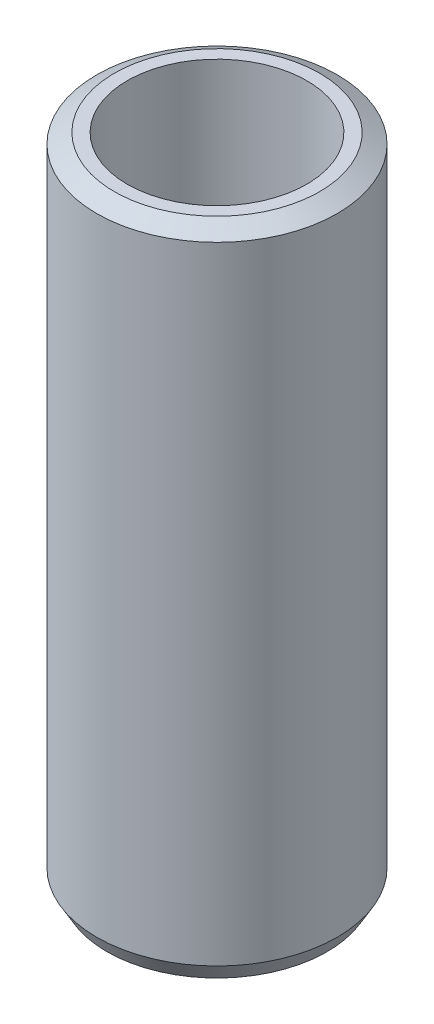
ISO-10303-21;
HEADER;
FILE_DESCRIPTION(('STEP AP214'),'2;1');
FILE_NAME('part.step','',(''),(''),'','','');
FILE_SCHEMA(('AUTOMOTIVE_DESIGN { 1 0 10303 214 1 1 1 1 }'));
ENDSEC;
DATA;
#1=APPLICATION_CONTEXT('core data for automotive mechanical design processes');
#2=APPLICATION_PROTOCOL_DEFINITION('international standard','automotive_design',2000,#1);
#3=PRODUCT_CONTEXT('',#1,'mechanical');
#4=PRODUCT('Part','Part','',(#3));
#5=PRODUCT_RELATED_PRODUCT_CATEGORY('part','',(#4));
#6=PRODUCT_DEFINITION_FORMATION('','',#4);
#7=PRODUCT_DEFINITION_CONTEXT('part definition',#1,'design');
#8=PRODUCT_DEFINITION('design','',#6,#7);
#9=PRODUCT_DEFINITION_SHAPE('','',#8);
#10=(LENGTH_UNIT() NAMED_UNIT(*) SI_UNIT(.MILLI.,.METRE.));
#11=(NAMED_UNIT(*) PLANE_ANGLE_UNIT() SI_UNIT($,.RADIAN.));
#12=(NAMED_UNIT(*) SI_UNIT($,.STERADIAN.) SOLID_ANGLE_UNIT());
#13=UNCERTAINTY_MEASURE_WITH_UNIT(LENGTH_MEASURE(1.E-05),#10,'distance_accuracy_value','');
#14=(GEOMETRIC_REPRESENTATION_CONTEXT(3) GLOBAL_UNCERTAINTY_ASSIGNED_CONTEXT((#13)) GLOBAL_UNIT_ASSIGNED_CONTEXT((#10,
#11,#12)) REPRESENTATION_CONTEXT('',''));
#15=CARTESIAN_POINT('',(0.,0.,0.));
#16=DIRECTION('',(0.,0.,1.));
#17=DIRECTION('',(1.,0.,0.));
#18=AXIS2_PLACEMENT_3D('',#15,#16,#17);
#19=CARTESIAN_POINT('',(0.,108.857491612631,0.));
#20=DIRECTION('',(0.,-1.,0.));
#21=DIRECTION('',(0.,0.,-1.));
#22=AXIS2_PLACEMENT_3D('',#19,#20,#21);
#23=CYLINDRICAL_SURFACE('',#22,20.);
#24=CARTESIAN_POINT('',(0.,107.166747624013,0.));
#25=DIRECTION('',(0.,1.,0.));
#26=DIRECTION('',(0.,0.,1.));
#27=AXIS2_PLACEMENT_3D('',#24,#25,#26);
#28=CIRCLE('',#27,20.);
#29=CARTESIAN_POINT('',(0.,107.166747624013,-20.));
#30=VERTEX_POINT('',#29);
#31=EDGE_CURVE('E50',#30,#30,#28,.F.);
#32=ORIENTED_EDGE('',*,*,#31,.T.);
#33=EDGE_LOOP('',(#32));
#34=FACE_BOUND('',#33,.T.);
#35=CARTESIAN_POINT('',(0.,2.92845449087716,0.));
#36=DIRECTION('',(0.,1.,0.));
#37=DIRECTION('',(0.,0.,1.));
#38=AXIS2_PLACEMENT_3D('',#35,#36,#37);
#39=CIRCLE('',#38,20.);
#40=CARTESIAN_POINT('',(0.,2.92845449087716,20.));
#41=VERTEX_POINT('',#40);
#42=EDGE_CURVE('E51',#41,#41,#39,.T.);
#43=ORIENTED_EDGE('',*,*,#42,.T.);
#44=EDGE_LOOP('',(#43));
#45=FACE_BOUND('',#44,.T.);
#46=ADVANCED_FACE('F39',(#34,#45),#23,.T.);
#47=CARTESIAN_POINT('',(0.,108.857491612631,0.));
#48=DIRECTION('',(0.,1.,0.));
#49=DIRECTION('',(0.,0.,1.));
#50=AXIS2_PLACEMENT_3D('',#47,#48,#49);
#51=PLANE('',#50);
#52=CARTESIAN_POINT('',(0.,108.857491612631,0.));
#53=DIRECTION('',(0.,1.,0.));
#54=DIRECTION('',(0.,0.,1.));
#55=AXIS2_PLACEMENT_3D('',#52,#53,#54);
#56=CIRCLE('',#55,17.0715455091228);
#57=CARTESIAN_POINT('',(0.,108.857491612631,-17.0715455091228));
#58=VERTEX_POINT('',#57);
#59=EDGE_CURVE('E54',#58,#58,#56,.T.);
#60=ORIENTED_EDGE('',*,*,#59,.T.);
#61=EDGE_LOOP('',(#60));
#62=FACE_BOUND('',#61,.T.);
#63=CARTESIAN_POINT('',(0.,108.857491612631,0.));
#64=DIRECTION('',(0.,1.,0.));
#65=DIRECTION('',(0.,0.,1.));
#66=AXIS2_PLACEMENT_3D('',#63,#64,#65);
#67=CIRCLE('',#66,14.9315232314958);
#68=CARTESIAN_POINT('',(0.,108.857491612631,14.9315232314958));
#69=VERTEX_POINT('',#68);
#70=EDGE_CURVE('E58',#69,#69,#67,.T.);
#71=ORIENTED_EDGE('',*,*,#70,.F.);
#72=EDGE_LOOP('',(#71));
#73=FACE_BOUND('',#72,.T.);
#74=ADVANCED_FACE('F69',(#62,#73),#51,.T.);
#75=CARTESIAN_POINT('',(0.,0.,0.));
#76=DIRECTION('',(0.,1.,0.));
#77=DIRECTION('',(0.,0.,1.));
#78=AXIS2_PLACEMENT_3D('',#75,#76,#77);
#79=PLANE('',#78);
#80=CARTESIAN_POINT('',(0.,0.,0.));
#81=DIRECTION('',(0.,1.,0.));
#82=DIRECTION('',(0.,0.,1.));
#83=AXIS2_PLACEMENT_3D('',#80,#81,#82);
#84=CIRCLE('',#83,18.3092560113825);
#85=CARTESIAN_POINT('',(0.,0.,18.3092560113825));
#86=VERTEX_POINT('',#85);
#87=EDGE_CURVE('E10',#86,#86,#84,.F.);
#88=ORIENTED_EDGE('',*,*,#87,.T.);
#89=EDGE_LOOP('',(#88));
#90=FACE_BOUND('',#89,.T.);
#91=CARTESIAN_POINT('',(0.,0.,0.));
#92=DIRECTION('',(0.,1.,0.));
#93=DIRECTION('',(0.,0.,1.));
#94=AXIS2_PLACEMENT_3D('',#91,#92,#93);
#95=CIRCLE('',#94,14.9315232314958);
#96=CARTESIAN_POINT('',(0.,0.,14.9315232314958));
#97=VERTEX_POINT('',#96);
#98=EDGE_CURVE('E63',#97,#97,#95,.T.);
#99=ORIENTED_EDGE('',*,*,#98,.T.);
#100=EDGE_LOOP('',(#99));
#101=FACE_BOUND('',#100,.T.);
#102=ADVANCED_FACE('F75',(#90,#101),#79,.F.);
#103=CARTESIAN_POINT('',(0.,108.857491612631,0.));
#104=DIRECTION('',(0.,-1.,0.));
#105=DIRECTION('',(0.,0.,-1.));
#106=AXIS2_PLACEMENT_3D('',#103,#104,#105);
#107=CYLINDRICAL_SURFACE('',#106,14.9315232314958);
#108=ORIENTED_EDGE('',*,*,#70,.T.);
#109=EDGE_LOOP('',(#108));
#110=FACE_BOUND('',#109,.T.);
#111=ORIENTED_EDGE('',*,*,#98,.F.);
#112=EDGE_LOOP('',(#111));
#113=FACE_BOUND('',#112,.T.);
#114=ADVANCED_FACE('F70',(#110,#113),#107,.F.);
#115=CARTESIAN_POINT('',(0.,108.857491612631,0.));
#116=DIRECTION('',(0.,-1.,0.));
#117=DIRECTION('',(0.,0.,-1.));
#118=AXIS2_PLACEMENT_3D('',#115,#116,#117);
#119=CONICAL_SURFACE('',#118,17.0715455091228,1.04719755119659);
#120=CARTESIAN_POINT('',(0.,107.166747624013,-20.));
#121=CARTESIAN_POINT('',(0.,107.184359540561,-19.96949526572));
#122=CARTESIAN_POINT('',(0.,107.201971457109,-19.9389905314401));
#123=CARTESIAN_POINT('',(0.,107.237195290205,-19.8779810628801));
#124=CARTESIAN_POINT('',(0.,107.254807206754,-19.8474763286002));
#125=CARTESIAN_POINT('',(0.,107.29003103985,-19.7864668600402));
#126=CARTESIAN_POINT('',(0.,107.307642956398,-19.7559621257602));
#127=CARTESIAN_POINT('',(0.,107.342866789494,-19.6949526572003));
#128=CARTESIAN_POINT('',(0.,107.360478706042,-19.6644479229203));
#129=CARTESIAN_POINT('',(0.,107.395702539138,-19.6034384543604));
#130=CARTESIAN_POINT('',(0.,107.413314455686,-19.5729337200804));
#131=CARTESIAN_POINT('',(0.,107.448538288783,-19.5119242515205));
#132=CARTESIAN_POINT('',(0.,107.466150205331,-19.4814195172405));
#133=CARTESIAN_POINT('',(0.,107.501374038427,-19.4204100486806));
#134=CARTESIAN_POINT('',(0.,107.518985954975,-19.3899053144006));
#135=CARTESIAN_POINT('',(0.,107.554209788071,-19.3288958458407));
#136=CARTESIAN_POINT('',(0.,107.571821704619,-19.2983911115607));
#137=CARTESIAN_POINT('',(0.,107.607045537716,-19.2373816430007));
#138=CARTESIAN_POINT('',(0.,107.624657454264,-19.2068769087208));
#139=CARTESIAN_POINT('',(0.,107.65988128736,-19.1458674401608));
#140=CARTESIAN_POINT('',(0.,107.677493203908,-19.1153627058809));
#141=CARTESIAN_POINT('',(0.,107.712717037004,-19.0543532373209));
#142=CARTESIAN_POINT('',(0.,107.730328953552,-19.023848503041));
#143=CARTESIAN_POINT('',(0.,107.765552786648,-18.962839034481));
#144=CARTESIAN_POINT('',(0.,107.783164703197,-18.932334300201));
#145=CARTESIAN_POINT('',(0.,107.818388536293,-18.8713248316411));
#146=CARTESIAN_POINT('',(0.,107.836000452841,-18.8408200973611));
#147=CARTESIAN_POINT('',(0.,107.871224285937,-18.7798106288012));
#148=CARTESIAN_POINT('',(0.,107.888836202485,-18.7493058945212));
#149=CARTESIAN_POINT('',(0.,107.924060035581,-18.6882964259613));
#150=CARTESIAN_POINT('',(0.,107.941671952129,-18.6577916916813));
#151=CARTESIAN_POINT('',(0.,107.976895785226,-18.5967822231214));
#152=CARTESIAN_POINT('',(0.,107.994507701774,-18.5662774888414));
#153=CARTESIAN_POINT('',(0.,108.02973153487,-18.5052680202815));
#154=CARTESIAN_POINT('',(0.,108.047343451418,-18.4747632860015));
#155=CARTESIAN_POINT('',(0.,108.082567284514,-18.4137538174415));
#156=CARTESIAN_POINT('',(0.,108.100179201062,-18.3832490831616));
#157=CARTESIAN_POINT('',(0.,108.135403034159,-18.3222396146016));
#158=CARTESIAN_POINT('',(0.,108.153014950707,-18.2917348803217));
#159=CARTESIAN_POINT('',(0.,108.188238783803,-18.2307254117617));
#160=CARTESIAN_POINT('',(0.,108.205850700351,-18.2002206774817));
#161=CARTESIAN_POINT('',(0.,108.241074533447,-18.1392112089218));
#162=CARTESIAN_POINT('',(0.,108.258686449995,-18.1087064746418));
#163=CARTESIAN_POINT('',(0.,108.293910283091,-18.0476970060819));
#164=CARTESIAN_POINT('',(0.,108.311522199639,-18.0171922718019));
#165=CARTESIAN_POINT('',(0.,108.346746032736,-17.956182803242));
#166=CARTESIAN_POINT('',(0.,108.364357949284,-17.925678068962));
#167=CARTESIAN_POINT('',(0.,108.39958178238,-17.8646686004021));
#168=CARTESIAN_POINT('',(0.,108.417193698928,-17.8341638661221));
#169=CARTESIAN_POINT('',(0.,108.452417532024,-17.7731543975622));
#170=CARTESIAN_POINT('',(0.,108.470029448572,-17.7426496632822));
#171=CARTESIAN_POINT('',(0.,108.505253281669,-17.6816401947222));
#172=CARTESIAN_POINT('',(0.,108.522865198217,-17.6511354604423));
#173=CARTESIAN_POINT('',(0.,108.558089031313,-17.5901259918823));
#174=CARTESIAN_POINT('',(0.,108.575700947861,-17.5596212576024));
#175=CARTESIAN_POINT('',(0.,108.610924780957,-17.4986117890424));
#176=CARTESIAN_POINT('',(0.,108.628536697505,-17.4681070547625));
#177=CARTESIAN_POINT('',(0.,108.663760530601,-17.4070975862025));
#178=CARTESIAN_POINT('',(0.,108.68137244715,-17.3765928519225));
#179=CARTESIAN_POINT('',(0.,108.716596280246,-17.3155833833626));
#180=CARTESIAN_POINT('',(0.,108.734208196794,-17.2850786490826));
#181=CARTESIAN_POINT('',(0.,108.76943202989,-17.2240691805227));
#182=CARTESIAN_POINT('',(0.,108.787043946438,-17.1935644462427));
#183=CARTESIAN_POINT('',(0.,108.822267779534,-17.1325549776828));
#184=CARTESIAN_POINT('',(0.,108.839879696082,-17.1020502434028));
#185=CARTESIAN_POINT('',(0.,108.857491612631,-17.0715455091228));
#186=B_SPLINE_CURVE_WITH_KNOTS('',3,(#120,#121,#122,#123,#124,#125,#126,#127,#128,#129,#130,
#131,#132,#133,#134,#135,#136,#137,#138,#139,#140,#141,#142,#143,#144,#145,#146,#147,#148,#149,
#150,#151,#152,#153,#154,#155,#156,#157,#158,#159,#160,#161,#162,#163,#164,#165,#166,#167,#168,
#169,#170,#171,#172,#173,#174,#175,#176,#177,#178,#179,#180,#181,#182,#183,#184,#185),
.UNSPECIFIED.,.F.,.F.,(4,2,2,2,2,2,2,2,2,2,2,2,2,2,2,2,2,2,2,2,2,2,2,2,2,2,2,2,2,2,2,2,4),(0.,
0.105671499288599,0.211342998577191,0.317014497865791,0.422685997154383,0.528357496442982,
0.634028995731571,0.739700495020163,0.845371994308763,0.951043493597355,1.05671499288595,
1.16238649217455,1.26805799146314,1.37372949075173,1.47940099004033,1.58507248932893,
1.69074398861752,1.79641548790611,1.90208698719471,2.0077584864833,2.1134299857719,
2.21910148506049,2.32477298434908,2.43044448363768,2.53611598292627,2.64178748221487,
2.74745898150346,2.85313048079205,2.95880198008065,3.06447347936924,3.17014497865784,
3.27581647794644,3.38148797723504),.UNSPECIFIED.);
#187=EDGE_CURVE('BSEAM81',#30,#58,#186,.T.);
#188=ORIENTED_EDGE('',*,*,#31,.F.);
#189=ORIENTED_EDGE('',*,*,#59,.F.);
#190=ORIENTED_EDGE('',*,*,#187,.T.);
#191=ORIENTED_EDGE('',*,*,#187,.F.);
#192=EDGE_LOOP('',(#188,#190,#189,#191));
#193=FACE_BOUND('',#192,.T.);
#194=ADVANCED_FACE('F81',(#193),#119,.T.);
#195=CARTESIAN_POINT('',(0.,2.92845449087716,0.));
#196=DIRECTION('',(0.,1.,0.));
#197=DIRECTION('',(0.,0.,1.));
#198=AXIS2_PLACEMENT_3D('',#195,#196,#197);
#199=CONICAL_SURFACE('',#198,20.,0.523598775598303);
#200=ORIENTED_EDGE('',*,*,#87,.F.);
#201=EDGE_LOOP('',(#200));
#202=FACE_BOUND('',#201,.T.);
#203=ORIENTED_EDGE('',*,*,#42,.F.);
#204=EDGE_LOOP('',(#203));
#205=FACE_BOUND('',#204,.T.);
#206=ADVANCED_FACE('F45',(#202,#205),#199,.T.);
#207=CLOSED_SHELL('',(#46,#74,#102,#114,#194,#206));
#208=MANIFOLD_SOLID_BREP('B2',#207);
#209=ADVANCED_BREP_SHAPE_REPRESENTATION('',(#18,#208),#14);
#210=SHAPE_DEFINITION_REPRESENTATION(#9,#209);
ENDSEC;
END-ISO-10303-21;
